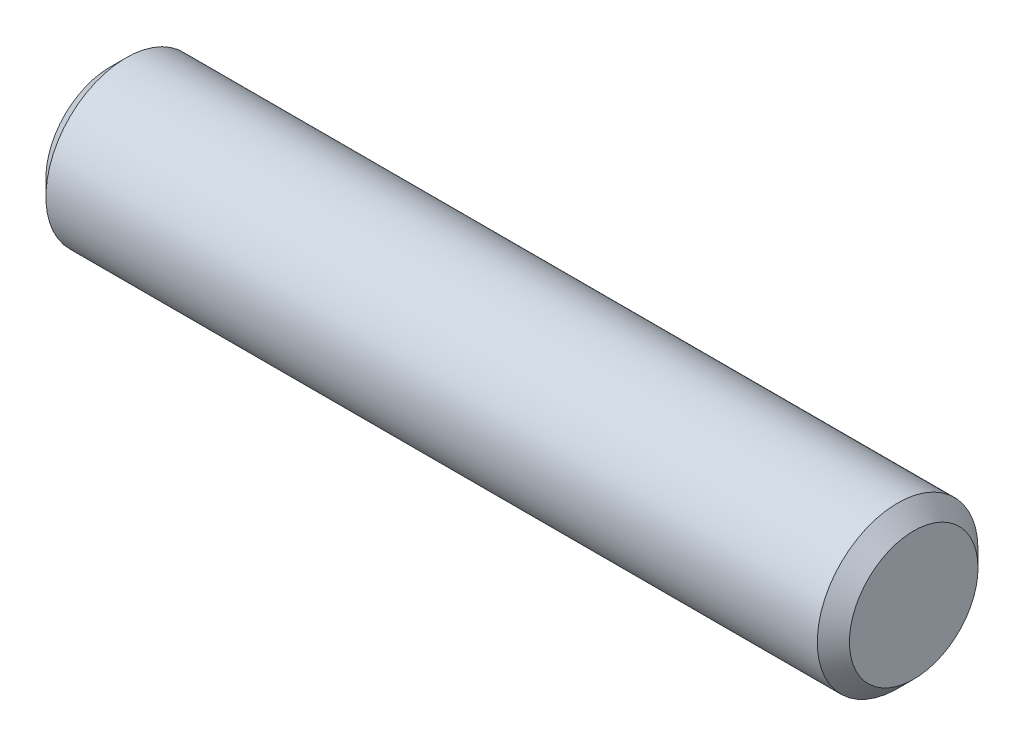
ISO-10303-21;
HEADER;
FILE_DESCRIPTION(('STEP AP214'),'2;1');
FILE_NAME('part.step','',(''),(''),'','','');
FILE_SCHEMA(('AUTOMOTIVE_DESIGN { 1 0 10303 214 1 1 1 1 }'));
ENDSEC;
DATA;
#1=APPLICATION_CONTEXT('core data for automotive mechanical design processes');
#2=APPLICATION_PROTOCOL_DEFINITION('international standard','automotive_design',2000,#1);
#3=PRODUCT_CONTEXT('',#1,'mechanical');
#4=PRODUCT('Part','Part','',(#3));
#5=PRODUCT_RELATED_PRODUCT_CATEGORY('part','',(#4));
#6=PRODUCT_DEFINITION_FORMATION('','',#4);
#7=PRODUCT_DEFINITION_CONTEXT('part definition',#1,'design');
#8=PRODUCT_DEFINITION('design','',#6,#7);
#9=PRODUCT_DEFINITION_SHAPE('','',#8);
#10=(LENGTH_UNIT() NAMED_UNIT(*) SI_UNIT(.MILLI.,.METRE.));
#11=(NAMED_UNIT(*) PLANE_ANGLE_UNIT() SI_UNIT($,.RADIAN.));
#12=(NAMED_UNIT(*) SI_UNIT($,.STERADIAN.) SOLID_ANGLE_UNIT());
#13=UNCERTAINTY_MEASURE_WITH_UNIT(LENGTH_MEASURE(1.E-05),#10,'distance_accuracy_value','');
#14=(GEOMETRIC_REPRESENTATION_CONTEXT(3) GLOBAL_UNCERTAINTY_ASSIGNED_CONTEXT((#13)) GLOBAL_UNIT_ASSIGNED_CONTEXT((#10,
#11,#12)) REPRESENTATION_CONTEXT('',''));
#15=CARTESIAN_POINT('',(0.,0.,0.));
#16=DIRECTION('',(0.,0.,1.));
#17=DIRECTION('',(1.,0.,0.));
#18=AXIS2_PLACEMENT_3D('',#15,#16,#17);
#19=CARTESIAN_POINT('',(-7.9375,0.,0.));
#20=DIRECTION('',(1.,0.,0.));
#21=DIRECTION('',(0.,0.,-1.));
#22=AXIS2_PLACEMENT_3D('',#19,#20,#21);
#23=CYLINDRICAL_SURFACE('',#22,1.5875);
#24=CARTESIAN_POINT('',(7.62,0.,0.));
#25=DIRECTION('',(1.,0.,0.));
#26=DIRECTION('',(0.,0.,-1.));
#27=AXIS2_PLACEMENT_3D('',#24,#25,#26);
#28=CIRCLE('',#27,1.5875);
#29=CARTESIAN_POINT('',(7.62,0.,-1.5875));
#30=VERTEX_POINT('',#29);
#31=EDGE_CURVE('E37',#30,#30,#28,.F.);
#32=ORIENTED_EDGE('',*,*,#31,.T.);
#33=EDGE_LOOP('',(#32));
#34=FACE_BOUND('',#33,.T.);
#35=CARTESIAN_POINT('',(-7.62,0.,0.));
#36=DIRECTION('',(1.,0.,0.));
#37=DIRECTION('',(0.,0.,-1.));
#38=AXIS2_PLACEMENT_3D('',#35,#36,#37);
#39=CIRCLE('',#38,1.5875);
#40=CARTESIAN_POINT('',(-7.62,0.,-1.5875));
#41=VERTEX_POINT('',#40);
#42=EDGE_CURVE('E41',#41,#41,#39,.T.);
#43=ORIENTED_EDGE('',*,*,#42,.T.);
#44=EDGE_LOOP('',(#43));
#45=FACE_BOUND('',#44,.T.);
#46=ADVANCED_FACE('F30',(#34,#45),#23,.T.);
#47=CARTESIAN_POINT('',(-7.9375,0.,0.));
#48=DIRECTION('',(1.,0.,0.));
#49=DIRECTION('',(0.,0.,-1.));
#50=AXIS2_PLACEMENT_3D('',#47,#48,#49);
#51=PLANE('',#50);
#52=CARTESIAN_POINT('',(-7.9375,0.,0.));
#53=DIRECTION('',(1.,0.,0.));
#54=DIRECTION('',(0.,0.,-1.));
#55=AXIS2_PLACEMENT_3D('',#52,#53,#54);
#56=CIRCLE('',#55,1.27);
#57=CARTESIAN_POINT('',(-7.9375,0.,-1.27));
#58=VERTEX_POINT('',#57);
#59=EDGE_CURVE('E10',#58,#58,#56,.F.);
#60=ORIENTED_EDGE('',*,*,#59,.T.);
#61=EDGE_LOOP('',(#60));
#62=FACE_BOUND('',#61,.T.);
#63=ADVANCED_FACE('F61',(#62),#51,.F.);
#64=CARTESIAN_POINT('',(7.9375,0.,0.));
#65=DIRECTION('',(1.,0.,0.));
#66=DIRECTION('',(0.,0.,-1.));
#67=AXIS2_PLACEMENT_3D('',#64,#65,#66);
#68=PLANE('',#67);
#69=CARTESIAN_POINT('',(7.9375,0.,0.));
#70=DIRECTION('',(1.,0.,0.));
#71=DIRECTION('',(0.,0.,-1.));
#72=AXIS2_PLACEMENT_3D('',#69,#70,#71);
#73=CIRCLE('',#72,1.27);
#74=CARTESIAN_POINT('',(7.9375,0.,-1.27));
#75=VERTEX_POINT('',#74);
#76=EDGE_CURVE('E45',#75,#75,#73,.T.);
#77=ORIENTED_EDGE('',*,*,#76,.T.);
#78=EDGE_LOOP('',(#77));
#79=FACE_BOUND('',#78,.T.);
#80=ADVANCED_FACE('F51',(#79),#68,.T.);
#81=CARTESIAN_POINT('',(7.9375,0.,0.));
#82=DIRECTION('',(-1.,0.,0.));
#83=DIRECTION('',(0.,0.,1.));
#84=AXIS2_PLACEMENT_3D('',#81,#82,#83);
#85=CONICAL_SURFACE('',#84,1.27,0.785398163397445);
#86=ORIENTED_EDGE('',*,*,#31,.F.);
#87=EDGE_LOOP('',(#86));
#88=FACE_BOUND('',#87,.T.);
#89=ORIENTED_EDGE('',*,*,#76,.F.);
#90=EDGE_LOOP('',(#89));
#91=FACE_BOUND('',#90,.T.);
#92=ADVANCED_FACE('F53',(#88,#91),#85,.T.);
#93=CARTESIAN_POINT('',(-7.62,0.,0.));
#94=DIRECTION('',(1.,0.,0.));
#95=DIRECTION('',(0.,0.,-1.));
#96=AXIS2_PLACEMENT_3D('',#93,#94,#95);
#97=CONICAL_SURFACE('',#96,1.5875,0.78539816339745);
#98=ORIENTED_EDGE('',*,*,#59,.F.);
#99=EDGE_LOOP('',(#98));
#100=FACE_BOUND('',#99,.T.);
#101=ORIENTED_EDGE('',*,*,#42,.F.);
#102=EDGE_LOOP('',(#101));
#103=FACE_BOUND('',#102,.T.);
#104=ADVANCED_FACE('F32',(#100,#103),#97,.T.);
#105=CLOSED_SHELL('',(#46,#63,#80,#92,#104));
#106=MANIFOLD_SOLID_BREP('B2',#105);
#107=ADVANCED_BREP_SHAPE_REPRESENTATION('',(#18,#106),#14);
#108=SHAPE_DEFINITION_REPRESENTATION(#9,#107);
ENDSEC;
END-ISO-10303-21;
